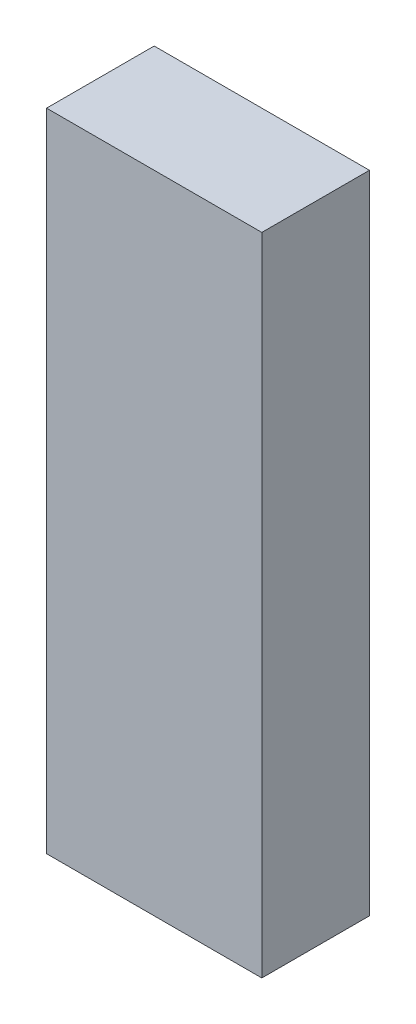
ISO-10303-21;
HEADER;
FILE_DESCRIPTION(('STEP AP214'),'2;1');
FILE_NAME('part.step','',(''),(''),'','','');
FILE_SCHEMA(('AUTOMOTIVE_DESIGN { 1 0 10303 214 1 1 1 1 }'));
ENDSEC;
DATA;
#1=APPLICATION_CONTEXT('core data for automotive mechanical design processes');
#2=APPLICATION_PROTOCOL_DEFINITION('international standard','automotive_design',2000,#1);
#3=PRODUCT_CONTEXT('',#1,'mechanical');
#4=PRODUCT('Part','Part','',(#3));
#5=PRODUCT_RELATED_PRODUCT_CATEGORY('part','',(#4));
#6=PRODUCT_DEFINITION_FORMATION('','',#4);
#7=PRODUCT_DEFINITION_CONTEXT('part definition',#1,'design');
#8=PRODUCT_DEFINITION('design','',#6,#7);
#9=PRODUCT_DEFINITION_SHAPE('','',#8);
#10=(LENGTH_UNIT() NAMED_UNIT(*) SI_UNIT(.MILLI.,.METRE.));
#11=(NAMED_UNIT(*) PLANE_ANGLE_UNIT() SI_UNIT($,.RADIAN.));
#12=(NAMED_UNIT(*) SI_UNIT($,.STERADIAN.) SOLID_ANGLE_UNIT());
#13=UNCERTAINTY_MEASURE_WITH_UNIT(LENGTH_MEASURE(1.E-05),#10,'distance_accuracy_value','');
#14=(GEOMETRIC_REPRESENTATION_CONTEXT(3) GLOBAL_UNCERTAINTY_ASSIGNED_CONTEXT((#13)) GLOBAL_UNIT_ASSIGNED_CONTEXT((#10,
#11,#12)) REPRESENTATION_CONTEXT('',''));
#15=CARTESIAN_POINT('',(0.,0.,0.));
#16=DIRECTION('',(0.,0.,1.));
#17=DIRECTION('',(1.,0.,0.));
#18=AXIS2_PLACEMENT_3D('',#15,#16,#17);
#19=CARTESIAN_POINT('',(-64.0973676639816,4.40757575757576,5.));
#20=DIRECTION('',(1.,0.,0.));
#21=DIRECTION('',(0.,1.,0.));
#22=AXIS2_PLACEMENT_3D('',#19,#20,#21);
#23=PLANE('',#22);
#24=DIRECTION('',(0.,-1.,0.));
#25=VECTOR('',#24,1.);
#26=CARTESIAN_POINT('',(-64.0973676639816,4.40757575757576,0.));
#27=LINE('',#26,#25);
#28=CARTESIAN_POINT('',(-64.0973676639816,4.40757575757576,0.));
#29=VERTEX_POINT('',#28);
#30=CARTESIAN_POINT('',(-64.0973676639816,-25.5924242424242,0.));
#31=VERTEX_POINT('',#30);
#32=EDGE_CURVE('E96',#29,#31,#27,.T.);
#33=ORIENTED_EDGE('',*,*,#32,.T.);
#34=DIRECTION('',(0.,0.,-1.));
#35=VECTOR('',#34,1.);
#36=CARTESIAN_POINT('',(-64.0973676639816,-25.5924242424242,5.));
#37=LINE('',#36,#35);
#38=CARTESIAN_POINT('',(-64.0973676639816,-25.5924242424242,5.));
#39=VERTEX_POINT('',#38);
#40=EDGE_CURVE('E11',#39,#31,#37,.T.);
#41=ORIENTED_EDGE('',*,*,#40,.F.);
#42=DIRECTION('',(0.,-1.,0.));
#43=VECTOR('',#42,1.);
#44=CARTESIAN_POINT('',(-64.0973676639816,4.40757575757576,5.));
#45=LINE('',#44,#43);
#46=CARTESIAN_POINT('',(-64.0973676639816,4.40757575757576,5.));
#47=VERTEX_POINT('',#46);
#48=EDGE_CURVE('E84',#47,#39,#45,.T.);
#49=ORIENTED_EDGE('',*,*,#48,.F.);
#50=DIRECTION('',(0.,0.,-1.));
#51=VECTOR('',#50,1.);
#52=CARTESIAN_POINT('',(-64.0973676639816,4.40757575757576,5.));
#53=LINE('',#52,#51);
#54=EDGE_CURVE('E92',#47,#29,#53,.T.);
#55=ORIENTED_EDGE('',*,*,#54,.T.);
#56=EDGE_LOOP('',(#33,#41,#49,#55));
#57=FACE_BOUND('',#56,.T.);
#58=ADVANCED_FACE('F33',(#57),#23,.F.);
#59=CARTESIAN_POINT('',(-64.0973676639816,-25.5924242424242,5.));
#60=DIRECTION('',(0.,1.,0.));
#61=DIRECTION('',(0.,0.,1.));
#62=AXIS2_PLACEMENT_3D('',#59,#60,#61);
#63=PLANE('',#62);
#64=DIRECTION('',(1.,0.,0.));
#65=VECTOR('',#64,1.);
#66=CARTESIAN_POINT('',(-64.0973676639816,-25.5924242424242,0.));
#67=LINE('',#66,#65);
#68=CARTESIAN_POINT('',(-54.0973676639816,-25.5924242424242,0.));
#69=VERTEX_POINT('',#68);
#70=EDGE_CURVE('E88',#31,#69,#67,.T.);
#71=ORIENTED_EDGE('',*,*,#70,.T.);
#72=DIRECTION('',(0.,0.,-1.));
#73=VECTOR('',#72,1.);
#74=CARTESIAN_POINT('',(-54.0973676639816,-25.5924242424242,5.));
#75=LINE('',#74,#73);
#76=CARTESIAN_POINT('',(-54.0973676639816,-25.5924242424242,5.));
#77=VERTEX_POINT('',#76);
#78=EDGE_CURVE('E41',#77,#69,#75,.T.);
#79=ORIENTED_EDGE('',*,*,#78,.F.);
#80=DIRECTION('',(1.,0.,0.));
#81=VECTOR('',#80,1.);
#82=CARTESIAN_POINT('',(-64.0973676639816,-25.5924242424242,5.));
#83=LINE('',#82,#81);
#84=EDGE_CURVE('E79',#39,#77,#83,.T.);
#85=ORIENTED_EDGE('',*,*,#84,.F.);
#86=ORIENTED_EDGE('',*,*,#40,.T.);
#87=EDGE_LOOP('',(#71,#79,#85,#86));
#88=FACE_BOUND('',#87,.T.);
#89=ADVANCED_FACE('F87',(#88),#63,.F.);
#90=CARTESIAN_POINT('',(-54.0973676639816,4.40757575757576,5.));
#91=DIRECTION('',(-1.,0.,0.));
#92=DIRECTION('',(0.,0.,1.));
#93=AXIS2_PLACEMENT_3D('',#90,#91,#92);
#94=PLANE('',#93);
#95=DIRECTION('',(0.,1.,0.));
#96=VECTOR('',#95,1.);
#97=CARTESIAN_POINT('',(-54.0973676639816,4.40757575757576,0.));
#98=LINE('',#97,#96);
#99=CARTESIAN_POINT('',(-54.0973676639816,4.40757575757576,0.));
#100=VERTEX_POINT('',#99);
#101=EDGE_CURVE('E66',#69,#100,#98,.T.);
#102=ORIENTED_EDGE('',*,*,#101,.T.);
#103=DIRECTION('',(0.,0.,-1.));
#104=VECTOR('',#103,1.);
#105=CARTESIAN_POINT('',(-54.0973676639816,4.40757575757576,5.));
#106=LINE('',#105,#104);
#107=CARTESIAN_POINT('',(-54.0973676639816,4.40757575757576,5.));
#108=VERTEX_POINT('',#107);
#109=EDGE_CURVE('E89',#108,#100,#106,.T.);
#110=ORIENTED_EDGE('',*,*,#109,.F.);
#111=DIRECTION('',(0.,1.,0.));
#112=VECTOR('',#111,1.);
#113=CARTESIAN_POINT('',(-54.0973676639816,4.40757575757576,5.));
#114=LINE('',#113,#112);
#115=EDGE_CURVE('E82',#77,#108,#114,.T.);
#116=ORIENTED_EDGE('',*,*,#115,.F.);
#117=ORIENTED_EDGE('',*,*,#78,.T.);
#118=EDGE_LOOP('',(#102,#110,#116,#117));
#119=FACE_BOUND('',#118,.T.);
#120=ADVANCED_FACE('F90',(#119),#94,.F.);
#121=CARTESIAN_POINT('',(-64.0973676639816,4.40757575757576,5.));
#122=DIRECTION('',(0.,-1.,0.));
#123=DIRECTION('',(0.,0.,-1.));
#124=AXIS2_PLACEMENT_3D('',#121,#122,#123);
#125=PLANE('',#124);
#126=DIRECTION('',(-1.,0.,0.));
#127=VECTOR('',#126,1.);
#128=CARTESIAN_POINT('',(-64.0973676639816,4.40757575757576,0.));
#129=LINE('',#128,#127);
#130=EDGE_CURVE('E72',#100,#29,#129,.T.);
#131=ORIENTED_EDGE('',*,*,#130,.T.);
#132=ORIENTED_EDGE('',*,*,#54,.F.);
#133=DIRECTION('',(-1.,0.,0.));
#134=VECTOR('',#133,1.);
#135=CARTESIAN_POINT('',(-64.0973676639816,4.40757575757576,5.));
#136=LINE('',#135,#134);
#137=EDGE_CURVE('E49',#108,#47,#136,.T.);
#138=ORIENTED_EDGE('',*,*,#137,.F.);
#139=ORIENTED_EDGE('',*,*,#109,.T.);
#140=EDGE_LOOP('',(#131,#132,#138,#139));
#141=FACE_BOUND('',#140,.T.);
#142=ADVANCED_FACE('F103',(#141),#125,.F.);
#143=CARTESIAN_POINT('',(0.,0.,5.));
#144=DIRECTION('',(0.,0.,1.));
#145=DIRECTION('',(1.,0.,0.));
#146=AXIS2_PLACEMENT_3D('',#143,#144,#145);
#147=PLANE('',#146);
#148=ORIENTED_EDGE('',*,*,#48,.T.);
#149=ORIENTED_EDGE('',*,*,#84,.T.);
#150=ORIENTED_EDGE('',*,*,#115,.T.);
#151=ORIENTED_EDGE('',*,*,#137,.T.);
#152=EDGE_LOOP('',(#148,#149,#150,#151));
#153=FACE_BOUND('',#152,.T.);
#154=ADVANCED_FACE('F80',(#153),#147,.T.);
#155=CARTESIAN_POINT('',(0.,0.,0.));
#156=DIRECTION('',(0.,0.,1.));
#157=DIRECTION('',(1.,0.,0.));
#158=AXIS2_PLACEMENT_3D('',#155,#156,#157);
#159=PLANE('',#158);
#160=ORIENTED_EDGE('',*,*,#32,.F.);
#161=ORIENTED_EDGE('',*,*,#130,.F.);
#162=ORIENTED_EDGE('',*,*,#101,.F.);
#163=ORIENTED_EDGE('',*,*,#70,.F.);
#164=EDGE_LOOP('',(#160,#161,#162,#163));
#165=FACE_BOUND('',#164,.T.);
#166=ADVANCED_FACE('F106',(#165),#159,.F.);
#167=CLOSED_SHELL('',(#58,#89,#120,#142,#154,#166));
#168=MANIFOLD_SOLID_BREP('B2',#167);
#169=ADVANCED_BREP_SHAPE_REPRESENTATION('',(#18,#168),#14);
#170=SHAPE_DEFINITION_REPRESENTATION(#9,#169);
ENDSEC;
END-ISO-10303-21;
